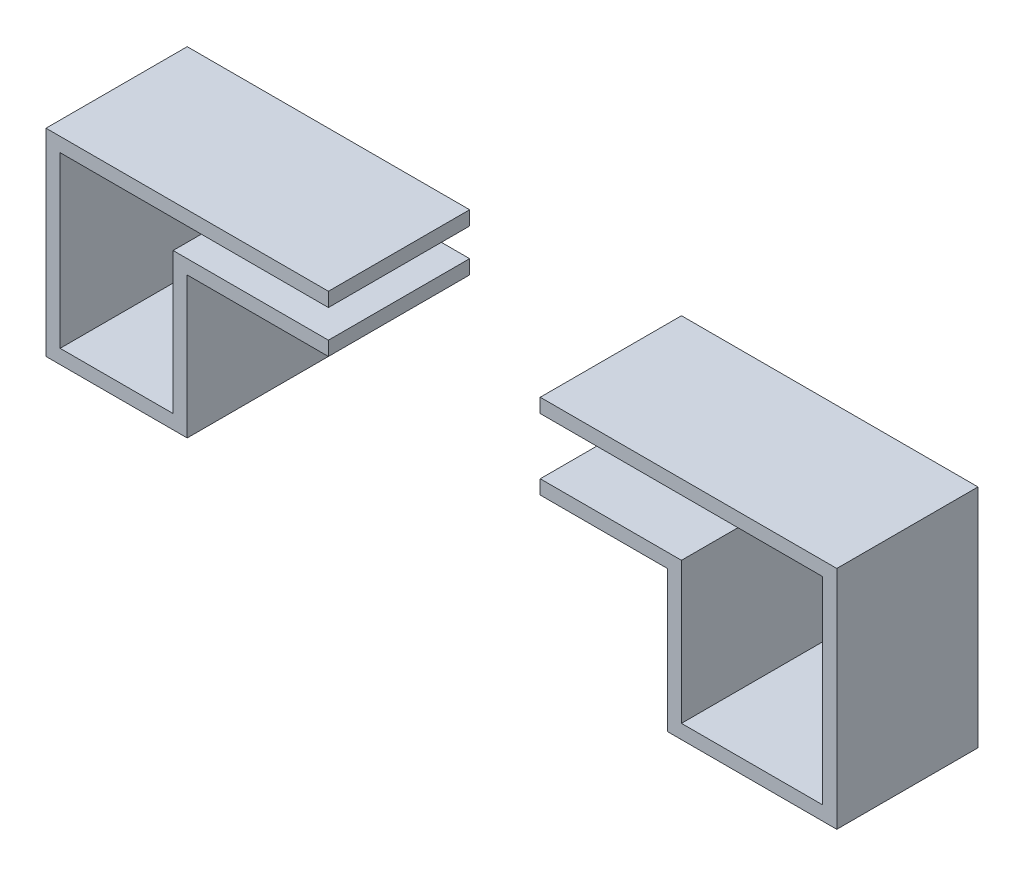
ISO-10303-21;
HEADER;
FILE_DESCRIPTION(('STEP AP214'),'2;1');
FILE_NAME('part.step','',(''),(''),'','','');
FILE_SCHEMA(('AUTOMOTIVE_DESIGN { 1 0 10303 214 1 1 1 1 }'));
ENDSEC;
DATA;
#1=APPLICATION_CONTEXT('core data for automotive mechanical design processes');
#2=APPLICATION_PROTOCOL_DEFINITION('international standard','automotive_design',2000,#1);
#3=PRODUCT_CONTEXT('',#1,'mechanical');
#4=PRODUCT('Part','Part','',(#3));
#5=PRODUCT_RELATED_PRODUCT_CATEGORY('part','',(#4));
#6=PRODUCT_DEFINITION_FORMATION('','',#4);
#7=PRODUCT_DEFINITION_CONTEXT('part definition',#1,'design');
#8=PRODUCT_DEFINITION('design','',#6,#7);
#9=PRODUCT_DEFINITION_SHAPE('','',#8);
#10=(LENGTH_UNIT() NAMED_UNIT(*) SI_UNIT(.MILLI.,.METRE.));
#11=(NAMED_UNIT(*) PLANE_ANGLE_UNIT() SI_UNIT($,.RADIAN.));
#12=(NAMED_UNIT(*) SI_UNIT($,.STERADIAN.) SOLID_ANGLE_UNIT());
#13=UNCERTAINTY_MEASURE_WITH_UNIT(LENGTH_MEASURE(1.E-05),#10,'distance_accuracy_value','');
#14=(GEOMETRIC_REPRESENTATION_CONTEXT(3) GLOBAL_UNCERTAINTY_ASSIGNED_CONTEXT((#13)) GLOBAL_UNIT_ASSIGNED_CONTEXT((#10,
#11,#12)) REPRESENTATION_CONTEXT('',''));
#15=CARTESIAN_POINT('',(0.,0.,0.));
#16=DIRECTION('',(0.,0.,1.));
#17=DIRECTION('',(1.,0.,0.));
#18=AXIS2_PLACEMENT_3D('',#15,#16,#17);
#19=CARTESIAN_POINT('',(1.375,0.75,0.5));
#20=DIRECTION('',(0.,-1.,0.));
#21=DIRECTION('',(1.,0.,0.));
#22=AXIS2_PLACEMENT_3D('',#19,#20,#21);
#23=PLANE('',#22);
#24=DIRECTION('',(-1.,0.,0.));
#25=VECTOR('',#24,1.);
#26=CARTESIAN_POINT('',(1.375,0.75,0.));
#27=LINE('',#26,#25);
#28=CARTESIAN_POINT('',(1.425,0.75,0.));
#29=VERTEX_POINT('',#28);
#30=CARTESIAN_POINT('',(0.374999999999999,0.75,0.));
#31=VERTEX_POINT('',#30);
#32=EDGE_CURVE('E178',#29,#31,#27,.T.);
#33=ORIENTED_EDGE('',*,*,#32,.T.);
#34=DIRECTION('',(0.,0.,-1.));
#35=VECTOR('',#34,1.);
#36=CARTESIAN_POINT('',(0.374999999999999,0.75,0.5));
#37=LINE('',#36,#35);
#38=CARTESIAN_POINT('',(0.374999999999999,0.75,0.5));
#39=VERTEX_POINT('',#38);
#40=EDGE_CURVE('E12',#39,#31,#37,.T.);
#41=ORIENTED_EDGE('',*,*,#40,.F.);
#42=DIRECTION('',(-1.,0.,0.));
#43=VECTOR('',#42,1.);
#44=CARTESIAN_POINT('',(1.375,0.75,0.5));
#45=LINE('',#44,#43);
#46=CARTESIAN_POINT('',(1.425,0.75,0.5));
#47=VERTEX_POINT('',#46);
#48=EDGE_CURVE('E122',#47,#39,#45,.T.);
#49=ORIENTED_EDGE('',*,*,#48,.F.);
#50=DIRECTION('',(0.,0.,-1.));
#51=VECTOR('',#50,1.);
#52=CARTESIAN_POINT('',(1.425,0.75,0.5));
#53=LINE('',#52,#51);
#54=EDGE_CURVE('E174',#47,#29,#53,.T.);
#55=ORIENTED_EDGE('',*,*,#54,.T.);
#56=EDGE_LOOP('',(#33,#41,#49,#55));
#57=FACE_BOUND('',#56,.T.);
#58=ADVANCED_FACE('F53',(#57),#23,.F.);
#59=CARTESIAN_POINT('',(0.374999999999999,0.7,0.5));
#60=DIRECTION('',(-1.,0.,0.));
#61=DIRECTION('',(0.,0.,1.));
#62=AXIS2_PLACEMENT_3D('',#59,#60,#61);
#63=PLANE('',#62);
#64=DIRECTION('',(0.,1.,0.));
#65=VECTOR('',#64,1.);
#66=CARTESIAN_POINT('',(0.374999999999999,0.7,0.));
#67=LINE('',#66,#65);
#68=CARTESIAN_POINT('',(0.374999999999999,0.7,0.));
#69=VERTEX_POINT('',#68);
#70=EDGE_CURVE('E182',#69,#31,#67,.T.);
#71=ORIENTED_EDGE('',*,*,#70,.F.);
#72=DIRECTION('',(0.,0.,-1.));
#73=VECTOR('',#72,1.);
#74=CARTESIAN_POINT('',(0.374999999999999,0.7,0.5));
#75=LINE('',#74,#73);
#76=CARTESIAN_POINT('',(0.374999999999999,0.7,0.5));
#77=VERTEX_POINT('',#76);
#78=EDGE_CURVE('E62',#77,#69,#75,.T.);
#79=ORIENTED_EDGE('',*,*,#78,.F.);
#80=DIRECTION('',(0.,1.,0.));
#81=VECTOR('',#80,1.);
#82=CARTESIAN_POINT('',(0.374999999999999,0.7,0.5));
#83=LINE('',#82,#81);
#84=EDGE_CURVE('E265',#77,#39,#83,.T.);
#85=ORIENTED_EDGE('',*,*,#84,.T.);
#86=ORIENTED_EDGE('',*,*,#40,.T.);
#87=EDGE_LOOP('',(#71,#79,#85,#86));
#88=FACE_BOUND('',#87,.T.);
#89=ADVANCED_FACE('F252',(#88),#63,.T.);
#90=CARTESIAN_POINT('',(1.375,0.7,0.5));
#91=DIRECTION('',(0.,-1.,0.));
#92=DIRECTION('',(1.,0.,0.));
#93=AXIS2_PLACEMENT_3D('',#90,#91,#92);
#94=PLANE('',#93);
#95=DIRECTION('',(-1.,0.,0.));
#96=VECTOR('',#95,1.);
#97=CARTESIAN_POINT('',(1.375,0.7,0.));
#98=LINE('',#97,#96);
#99=CARTESIAN_POINT('',(1.375,0.7,0.));
#100=VERTEX_POINT('',#99);
#101=EDGE_CURVE('E186',#100,#69,#98,.T.);
#102=ORIENTED_EDGE('',*,*,#101,.F.);
#103=DIRECTION('',(0.,0.,-1.));
#104=VECTOR('',#103,1.);
#105=CARTESIAN_POINT('',(1.375,0.7,0.5));
#106=LINE('',#105,#104);
#107=CARTESIAN_POINT('',(1.375,0.7,0.5));
#108=VERTEX_POINT('',#107);
#109=EDGE_CURVE('E240',#108,#100,#106,.T.);
#110=ORIENTED_EDGE('',*,*,#109,.F.);
#111=DIRECTION('',(-1.,0.,0.));
#112=VECTOR('',#111,1.);
#113=CARTESIAN_POINT('',(1.375,0.7,0.5));
#114=LINE('',#113,#112);
#115=EDGE_CURVE('E249',#108,#77,#114,.T.);
#116=ORIENTED_EDGE('',*,*,#115,.T.);
#117=ORIENTED_EDGE('',*,*,#78,.T.);
#118=EDGE_LOOP('',(#102,#110,#116,#117));
#119=FACE_BOUND('',#118,.T.);
#120=ADVANCED_FACE('F247',(#119),#94,.T.);
#121=CARTESIAN_POINT('',(1.375,0.,0.5));
#122=DIRECTION('',(-1.,0.,0.));
#123=DIRECTION('',(0.,0.,1.));
#124=AXIS2_PLACEMENT_3D('',#121,#122,#123);
#125=PLANE('',#124);
#126=DIRECTION('',(0.,1.,0.));
#127=VECTOR('',#126,1.);
#128=CARTESIAN_POINT('',(1.375,0.,0.));
#129=LINE('',#128,#127);
#130=CARTESIAN_POINT('',(1.375,0.,0.));
#131=VERTEX_POINT('',#130);
#132=EDGE_CURVE('E190',#131,#100,#129,.T.);
#133=ORIENTED_EDGE('',*,*,#132,.F.);
#134=DIRECTION('',(0.,0.,-1.));
#135=VECTOR('',#134,1.);
#136=CARTESIAN_POINT('',(1.375,0.,0.5));
#137=LINE('',#136,#135);
#138=CARTESIAN_POINT('',(1.375,0.,0.5));
#139=VERTEX_POINT('',#138);
#140=EDGE_CURVE('E237',#139,#131,#137,.T.);
#141=ORIENTED_EDGE('',*,*,#140,.F.);
#142=DIRECTION('',(0.,1.,0.));
#143=VECTOR('',#142,1.);
#144=CARTESIAN_POINT('',(1.375,0.,0.5));
#145=LINE('',#144,#143);
#146=EDGE_CURVE('E262',#139,#108,#145,.T.);
#147=ORIENTED_EDGE('',*,*,#146,.T.);
#148=ORIENTED_EDGE('',*,*,#109,.T.);
#149=EDGE_LOOP('',(#133,#141,#147,#148));
#150=FACE_BOUND('',#149,.T.);
#151=ADVANCED_FACE('F259',(#150),#125,.T.);
#152=CARTESIAN_POINT('',(0.874999999999999,0.,0.5));
#153=DIRECTION('',(0.,1.,0.));
#154=DIRECTION('',(0.,0.,1.));
#155=AXIS2_PLACEMENT_3D('',#152,#153,#154);
#156=PLANE('',#155);
#157=DIRECTION('',(1.,0.,0.));
#158=VECTOR('',#157,1.);
#159=CARTESIAN_POINT('',(0.874999999999999,0.,0.));
#160=LINE('',#159,#158);
#161=CARTESIAN_POINT('',(0.874999999999999,0.,0.));
#162=VERTEX_POINT('',#161);
#163=EDGE_CURVE('E194',#162,#131,#160,.T.);
#164=ORIENTED_EDGE('',*,*,#163,.F.);
#165=DIRECTION('',(0.,0.,-1.));
#166=VECTOR('',#165,1.);
#167=CARTESIAN_POINT('',(0.874999999999999,0.,0.5));
#168=LINE('',#167,#166);
#169=CARTESIAN_POINT('',(0.874999999999999,0.,0.5));
#170=VERTEX_POINT('',#169);
#171=EDGE_CURVE('E234',#170,#162,#168,.T.);
#172=ORIENTED_EDGE('',*,*,#171,.F.);
#173=DIRECTION('',(1.,0.,0.));
#174=VECTOR('',#173,1.);
#175=CARTESIAN_POINT('',(0.874999999999999,0.,0.5));
#176=LINE('',#175,#174);
#177=EDGE_CURVE('E270',#170,#139,#176,.T.);
#178=ORIENTED_EDGE('',*,*,#177,.T.);
#179=ORIENTED_EDGE('',*,*,#140,.T.);
#180=EDGE_LOOP('',(#164,#172,#178,#179));
#181=FACE_BOUND('',#180,.T.);
#182=ADVANCED_FACE('F382',(#181),#156,.T.);
#183=CARTESIAN_POINT('',(0.874999999999999,0.,0.5));
#184=DIRECTION('',(1.,0.,0.));
#185=DIRECTION('',(0.,0.,-1.));
#186=AXIS2_PLACEMENT_3D('',#183,#184,#185);
#187=PLANE('',#186);
#188=DIRECTION('',(0.,-1.,0.));
#189=VECTOR('',#188,1.);
#190=CARTESIAN_POINT('',(0.874999999999999,0.,0.));
#191=LINE('',#190,#189);
#192=CARTESIAN_POINT('',(0.874999999999999,0.5,0.));
#193=VERTEX_POINT('',#192);
#194=EDGE_CURVE('E198',#193,#162,#191,.T.);
#195=ORIENTED_EDGE('',*,*,#194,.F.);
#196=DIRECTION('',(0.,0.,-1.));
#197=VECTOR('',#196,1.);
#198=CARTESIAN_POINT('',(0.874999999999999,0.5,0.5));
#199=LINE('',#198,#197);
#200=CARTESIAN_POINT('',(0.874999999999999,0.5,0.5));
#201=VERTEX_POINT('',#200);
#202=EDGE_CURVE('E231',#201,#193,#199,.T.);
#203=ORIENTED_EDGE('',*,*,#202,.F.);
#204=DIRECTION('',(0.,-1.,0.));
#205=VECTOR('',#204,1.);
#206=CARTESIAN_POINT('',(0.874999999999999,0.,0.5));
#207=LINE('',#206,#205);
#208=EDGE_CURVE('E277',#201,#170,#207,.T.);
#209=ORIENTED_EDGE('',*,*,#208,.T.);
#210=ORIENTED_EDGE('',*,*,#171,.T.);
#211=EDGE_LOOP('',(#195,#203,#209,#210));
#212=FACE_BOUND('',#211,.T.);
#213=ADVANCED_FACE('F372',(#212),#187,.T.);
#214=CARTESIAN_POINT('',(0.874999999999999,0.5,0.5));
#215=DIRECTION('',(0.,1.,0.));
#216=DIRECTION('',(-1.,0.,0.));
#217=AXIS2_PLACEMENT_3D('',#214,#215,#216);
#218=PLANE('',#217);
#219=DIRECTION('',(1.,0.,0.));
#220=VECTOR('',#219,1.);
#221=CARTESIAN_POINT('',(0.874999999999999,0.5,0.));
#222=LINE('',#221,#220);
#223=CARTESIAN_POINT('',(0.374999999999999,0.5,0.));
#224=VERTEX_POINT('',#223);
#225=EDGE_CURVE('E202',#224,#193,#222,.T.);
#226=ORIENTED_EDGE('',*,*,#225,.F.);
#227=DIRECTION('',(0.,0.,-1.));
#228=VECTOR('',#227,1.);
#229=CARTESIAN_POINT('',(0.374999999999999,0.5,0.5));
#230=LINE('',#229,#228);
#231=CARTESIAN_POINT('',(0.374999999999999,0.5,0.5));
#232=VERTEX_POINT('',#231);
#233=EDGE_CURVE('E228',#232,#224,#230,.T.);
#234=ORIENTED_EDGE('',*,*,#233,.F.);
#235=DIRECTION('',(1.,0.,0.));
#236=VECTOR('',#235,1.);
#237=CARTESIAN_POINT('',(0.874999999999999,0.5,0.5));
#238=LINE('',#237,#236);
#239=EDGE_CURVE('E281',#232,#201,#238,.T.);
#240=ORIENTED_EDGE('',*,*,#239,.T.);
#241=ORIENTED_EDGE('',*,*,#202,.T.);
#242=EDGE_LOOP('',(#226,#234,#240,#241));
#243=FACE_BOUND('',#242,.T.);
#244=ADVANCED_FACE('F296',(#243),#218,.T.);
#245=CARTESIAN_POINT('',(0.374999999999999,0.45,0.5));
#246=DIRECTION('',(-1.,0.,0.));
#247=DIRECTION('',(0.,0.,1.));
#248=AXIS2_PLACEMENT_3D('',#245,#246,#247);
#249=PLANE('',#248);
#250=DIRECTION('',(0.,1.,0.));
#251=VECTOR('',#250,1.);
#252=CARTESIAN_POINT('',(0.374999999999999,0.45,0.));
#253=LINE('',#252,#251);
#254=CARTESIAN_POINT('',(0.374999999999999,0.45,0.));
#255=VERTEX_POINT('',#254);
#256=EDGE_CURVE('E206',#255,#224,#253,.T.);
#257=ORIENTED_EDGE('',*,*,#256,.F.);
#258=DIRECTION('',(0.,0.,-1.));
#259=VECTOR('',#258,1.);
#260=CARTESIAN_POINT('',(0.374999999999999,0.45,0.5));
#261=LINE('',#260,#259);
#262=CARTESIAN_POINT('',(0.374999999999999,0.45,0.5));
#263=VERTEX_POINT('',#262);
#264=EDGE_CURVE('E225',#263,#255,#261,.T.);
#265=ORIENTED_EDGE('',*,*,#264,.F.);
#266=DIRECTION('',(0.,1.,0.));
#267=VECTOR('',#266,1.);
#268=CARTESIAN_POINT('',(0.374999999999999,0.45,0.5));
#269=LINE('',#268,#267);
#270=EDGE_CURVE('E285',#263,#232,#269,.T.);
#271=ORIENTED_EDGE('',*,*,#270,.T.);
#272=ORIENTED_EDGE('',*,*,#233,.T.);
#273=EDGE_LOOP('',(#257,#265,#271,#272));
#274=FACE_BOUND('',#273,.T.);
#275=ADVANCED_FACE('F291',(#274),#249,.T.);
#276=CARTESIAN_POINT('',(0.874999999999999,0.45,0.5));
#277=DIRECTION('',(0.,1.,0.));
#278=DIRECTION('',(-1.,0.,0.));
#279=AXIS2_PLACEMENT_3D('',#276,#277,#278);
#280=PLANE('',#279);
#281=DIRECTION('',(1.,0.,0.));
#282=VECTOR('',#281,1.);
#283=CARTESIAN_POINT('',(0.874999999999999,0.45,0.));
#284=LINE('',#283,#282);
#285=CARTESIAN_POINT('',(0.824999999999999,0.45,0.));
#286=VERTEX_POINT('',#285);
#287=EDGE_CURVE('E210',#255,#286,#284,.T.);
#288=ORIENTED_EDGE('',*,*,#287,.T.);
#289=DIRECTION('',(0.,0.,-1.));
#290=VECTOR('',#289,1.);
#291=CARTESIAN_POINT('',(0.824999999999999,0.45,0.5));
#292=LINE('',#291,#290);
#293=CARTESIAN_POINT('',(0.824999999999999,0.45,0.5));
#294=VERTEX_POINT('',#293);
#295=EDGE_CURVE('E167',#294,#286,#292,.T.);
#296=ORIENTED_EDGE('',*,*,#295,.F.);
#297=DIRECTION('',(1.,0.,0.));
#298=VECTOR('',#297,1.);
#299=CARTESIAN_POINT('',(0.874999999999999,0.45,0.5));
#300=LINE('',#299,#298);
#301=EDGE_CURVE('E156',#263,#294,#300,.T.);
#302=ORIENTED_EDGE('',*,*,#301,.F.);
#303=ORIENTED_EDGE('',*,*,#264,.T.);
#304=EDGE_LOOP('',(#288,#296,#302,#303));
#305=FACE_BOUND('',#304,.T.);
#306=ADVANCED_FACE('F300',(#305),#280,.F.);
#307=CARTESIAN_POINT('',(0.824999999999999,0.,0.5));
#308=DIRECTION('',(1.,0.,0.));
#309=DIRECTION('',(0.,0.,-1.));
#310=AXIS2_PLACEMENT_3D('',#307,#308,#309);
#311=PLANE('',#310);
#312=DIRECTION('',(0.,1.,0.));
#313=VECTOR('',#312,1.);
#314=CARTESIAN_POINT('',(0.824999999999999,0.,0.));
#315=LINE('',#314,#313);
#316=CARTESIAN_POINT('',(0.824999999999999,-0.05,0.));
#317=VERTEX_POINT('',#316);
#318=EDGE_CURVE('E165',#286,#317,#315,.F.);
#319=ORIENTED_EDGE('',*,*,#318,.T.);
#320=DIRECTION('',(0.,0.,-1.));
#321=VECTOR('',#320,1.);
#322=CARTESIAN_POINT('',(0.824999999999999,-0.05,0.5));
#323=LINE('',#322,#321);
#324=CARTESIAN_POINT('',(0.824999999999999,-0.05,0.5));
#325=VERTEX_POINT('',#324);
#326=EDGE_CURVE('E162',#325,#317,#323,.T.);
#327=ORIENTED_EDGE('',*,*,#326,.F.);
#328=DIRECTION('',(0.,1.,0.));
#329=VECTOR('',#328,1.);
#330=CARTESIAN_POINT('',(0.824999999999999,0.,0.5));
#331=LINE('',#330,#329);
#332=EDGE_CURVE('E149',#294,#325,#331,.F.);
#333=ORIENTED_EDGE('',*,*,#332,.F.);
#334=ORIENTED_EDGE('',*,*,#295,.T.);
#335=EDGE_LOOP('',(#319,#327,#333,#334));
#336=FACE_BOUND('',#335,.T.);
#337=ADVANCED_FACE('F163',(#336),#311,.F.);
#338=CARTESIAN_POINT('',(0.874999999999999,-0.05,0.5));
#339=DIRECTION('',(0.,1.,0.));
#340=DIRECTION('',(0.,0.,1.));
#341=AXIS2_PLACEMENT_3D('',#338,#339,#340);
#342=PLANE('',#341);
#343=DIRECTION('',(1.,0.,0.));
#344=VECTOR('',#343,1.);
#345=CARTESIAN_POINT('',(0.874999999999999,-0.05,0.));
#346=LINE('',#345,#344);
#347=CARTESIAN_POINT('',(1.425,-0.05,0.));
#348=VERTEX_POINT('',#347);
#349=EDGE_CURVE('E110',#317,#348,#346,.T.);
#350=ORIENTED_EDGE('',*,*,#349,.T.);
#351=DIRECTION('',(0.,0.,-1.));
#352=VECTOR('',#351,1.);
#353=CARTESIAN_POINT('',(1.425,-0.05,0.5));
#354=LINE('',#353,#352);
#355=CARTESIAN_POINT('',(1.425,-0.05,0.5));
#356=VERTEX_POINT('',#355);
#357=EDGE_CURVE('E168',#356,#348,#354,.T.);
#358=ORIENTED_EDGE('',*,*,#357,.F.);
#359=DIRECTION('',(1.,0.,0.));
#360=VECTOR('',#359,1.);
#361=CARTESIAN_POINT('',(0.874999999999999,-0.05,0.5));
#362=LINE('',#361,#360);
#363=EDGE_CURVE('E153',#325,#356,#362,.T.);
#364=ORIENTED_EDGE('',*,*,#363,.F.);
#365=ORIENTED_EDGE('',*,*,#326,.T.);
#366=EDGE_LOOP('',(#350,#358,#364,#365));
#367=FACE_BOUND('',#366,.T.);
#368=ADVANCED_FACE('F170',(#367),#342,.F.);
#369=CARTESIAN_POINT('',(1.425,0.,0.5));
#370=DIRECTION('',(-1.,0.,0.));
#371=DIRECTION('',(0.,0.,1.));
#372=AXIS2_PLACEMENT_3D('',#369,#370,#371);
#373=PLANE('',#372);
#374=DIRECTION('',(0.,1.,0.));
#375=VECTOR('',#374,1.);
#376=CARTESIAN_POINT('',(1.425,0.,0.));
#377=LINE('',#376,#375);
#378=EDGE_CURVE('E116',#348,#29,#377,.T.);
#379=ORIENTED_EDGE('',*,*,#378,.T.);
#380=ORIENTED_EDGE('',*,*,#54,.F.);
#381=DIRECTION('',(0.,1.,0.));
#382=VECTOR('',#381,1.);
#383=CARTESIAN_POINT('',(1.425,0.,0.5));
#384=LINE('',#383,#382);
#385=EDGE_CURVE('E70',#356,#47,#384,.T.);
#386=ORIENTED_EDGE('',*,*,#385,.F.);
#387=ORIENTED_EDGE('',*,*,#357,.T.);
#388=EDGE_LOOP('',(#379,#380,#386,#387));
#389=FACE_BOUND('',#388,.T.);
#390=ADVANCED_FACE('F314',(#389),#373,.F.);
#391=CARTESIAN_POINT('',(0.,0.,0.5));
#392=DIRECTION('',(0.,0.,-1.));
#393=DIRECTION('',(-1.,0.,0.));
#394=AXIS2_PLACEMENT_3D('',#391,#392,#393);
#395=PLANE('',#394);
#396=ORIENTED_EDGE('',*,*,#48,.T.);
#397=ORIENTED_EDGE('',*,*,#84,.F.);
#398=ORIENTED_EDGE('',*,*,#115,.F.);
#399=ORIENTED_EDGE('',*,*,#146,.F.);
#400=ORIENTED_EDGE('',*,*,#177,.F.);
#401=ORIENTED_EDGE('',*,*,#208,.F.);
#402=ORIENTED_EDGE('',*,*,#239,.F.);
#403=ORIENTED_EDGE('',*,*,#270,.F.);
#404=ORIENTED_EDGE('',*,*,#301,.T.);
#405=ORIENTED_EDGE('',*,*,#332,.T.);
#406=ORIENTED_EDGE('',*,*,#363,.T.);
#407=ORIENTED_EDGE('',*,*,#385,.T.);
#408=EDGE_LOOP('',(#396,#397,#398,#399,#400,#401,#402,#403,#404,#405,#406,#407));
#409=FACE_BOUND('',#408,.T.);
#410=ADVANCED_FACE('F151',(#409),#395,.F.);
#411=CARTESIAN_POINT('',(0.,0.,0.));
#412=DIRECTION('',(0.,0.,-1.));
#413=DIRECTION('',(-1.,0.,0.));
#414=AXIS2_PLACEMENT_3D('',#411,#412,#413);
#415=PLANE('',#414);
#416=ORIENTED_EDGE('',*,*,#32,.F.);
#417=ORIENTED_EDGE('',*,*,#378,.F.);
#418=ORIENTED_EDGE('',*,*,#349,.F.);
#419=ORIENTED_EDGE('',*,*,#318,.F.);
#420=ORIENTED_EDGE('',*,*,#287,.F.);
#421=ORIENTED_EDGE('',*,*,#256,.T.);
#422=ORIENTED_EDGE('',*,*,#225,.T.);
#423=ORIENTED_EDGE('',*,*,#194,.T.);
#424=ORIENTED_EDGE('',*,*,#163,.T.);
#425=ORIENTED_EDGE('',*,*,#132,.T.);
#426=ORIENTED_EDGE('',*,*,#101,.T.);
#427=ORIENTED_EDGE('',*,*,#70,.T.);
#428=EDGE_LOOP('',(#416,#417,#418,#419,#420,#421,#422,#423,#424,#425,#426,#427));
#429=FACE_BOUND('',#428,.T.);
#430=ADVANCED_FACE('F255',(#429),#415,.T.);
#431=CLOSED_SHELL('',(#58,#89,#120,#151,#182,#213,#244,#275,#306,#337,#368,#390,#410,#430));
#432=MANIFOLD_SOLID_BREP('B2',#431);
#433=CARTESIAN_POINT('',(-1.375,0.65,0.5));
#434=DIRECTION('',(0.,1.,0.));
#435=DIRECTION('',(0.,0.,1.));
#436=AXIS2_PLACEMENT_3D('',#433,#434,#435);
#437=PLANE('',#436);
#438=DIRECTION('',(1.,0.,0.));
#439=VECTOR('',#438,1.);
#440=CARTESIAN_POINT('',(-1.375,0.65,0.));
#441=LINE('',#440,#439);
#442=CARTESIAN_POINT('',(-1.325,0.65,0.));
#443=VERTEX_POINT('',#442);
#444=CARTESIAN_POINT('',(-0.375,0.65,0.));
#445=VERTEX_POINT('',#444);
#446=EDGE_CURVE('E569',#443,#445,#441,.T.);
#447=ORIENTED_EDGE('',*,*,#446,.T.);
#448=DIRECTION('',(0.,0.,-1.));
#449=VECTOR('',#448,1.);
#450=CARTESIAN_POINT('',(-0.375,0.65,0.5));
#451=LINE('',#450,#449);
#452=CARTESIAN_POINT('',(-0.375,0.65,0.5));
#453=VERTEX_POINT('',#452);
#454=EDGE_CURVE('E51',#453,#445,#451,.T.);
#455=ORIENTED_EDGE('',*,*,#454,.F.);
#456=DIRECTION('',(1.,0.,0.));
#457=VECTOR('',#456,1.);
#458=CARTESIAN_POINT('',(-1.375,0.65,0.5));
#459=LINE('',#458,#457);
#460=CARTESIAN_POINT('',(-1.325,0.65,0.5));
#461=VERTEX_POINT('',#460);
#462=EDGE_CURVE('E517',#461,#453,#459,.T.);
#463=ORIENTED_EDGE('',*,*,#462,.F.);
#464=DIRECTION('',(0.,0.,-1.));
#465=VECTOR('',#464,1.);
#466=CARTESIAN_POINT('',(-1.325,0.65,0.5));
#467=LINE('',#466,#465);
#468=EDGE_CURVE('E565',#461,#443,#467,.T.);
#469=ORIENTED_EDGE('',*,*,#468,.T.);
#470=EDGE_LOOP('',(#447,#455,#463,#469));
#471=FACE_BOUND('',#470,.T.);
#472=ADVANCED_FACE('F449',(#471),#437,.F.);
#473=CARTESIAN_POINT('',(-0.375,0.7,0.5));
#474=DIRECTION('',(1.,0.,0.));
#475=DIRECTION('',(0.,0.,-1.));
#476=AXIS2_PLACEMENT_3D('',#473,#474,#475);
#477=PLANE('',#476);
#478=DIRECTION('',(0.,-1.,0.));
#479=VECTOR('',#478,1.);
#480=CARTESIAN_POINT('',(-0.375,0.7,0.));
#481=LINE('',#480,#479);
#482=CARTESIAN_POINT('',(-0.375,0.7,0.));
#483=VERTEX_POINT('',#482);
#484=EDGE_CURVE('E572',#483,#445,#481,.T.);
#485=ORIENTED_EDGE('',*,*,#484,.F.);
#486=DIRECTION('',(0.,0.,-1.));
#487=VECTOR('',#486,1.);
#488=CARTESIAN_POINT('',(-0.375,0.7,0.5));
#489=LINE('',#488,#487);
#490=CARTESIAN_POINT('',(-0.375,0.7,0.5));
#491=VERTEX_POINT('',#490);
#492=EDGE_CURVE('E457',#491,#483,#489,.T.);
#493=ORIENTED_EDGE('',*,*,#492,.F.);
#494=DIRECTION('',(0.,-1.,0.));
#495=VECTOR('',#494,1.);
#496=CARTESIAN_POINT('',(-0.375,0.7,0.5));
#497=LINE('',#496,#495);
#498=EDGE_CURVE('E634',#491,#453,#497,.T.);
#499=ORIENTED_EDGE('',*,*,#498,.T.);
#500=ORIENTED_EDGE('',*,*,#454,.T.);
#501=EDGE_LOOP('',(#485,#493,#499,#500));
#502=FACE_BOUND('',#501,.T.);
#503=ADVANCED_FACE('F621',(#502),#477,.T.);
#504=CARTESIAN_POINT('',(-1.375,0.7,0.5));
#505=DIRECTION('',(0.,1.,0.));
#506=DIRECTION('',(0.,0.,1.));
#507=AXIS2_PLACEMENT_3D('',#504,#505,#506);
#508=PLANE('',#507);
#509=DIRECTION('',(1.,0.,0.));
#510=VECTOR('',#509,1.);
#511=CARTESIAN_POINT('',(-1.375,0.7,0.));
#512=LINE('',#511,#510);
#513=CARTESIAN_POINT('',(-1.375,0.7,0.));
#514=VERTEX_POINT('',#513);
#515=EDGE_CURVE('E575',#514,#483,#512,.T.);
#516=ORIENTED_EDGE('',*,*,#515,.F.);
#517=DIRECTION('',(0.,0.,-1.));
#518=VECTOR('',#517,1.);
#519=CARTESIAN_POINT('',(-1.375,0.7,0.5));
#520=LINE('',#519,#518);
#521=CARTESIAN_POINT('',(-1.375,0.7,0.5));
#522=VERTEX_POINT('',#521);
#523=EDGE_CURVE('E611',#522,#514,#520,.T.);
#524=ORIENTED_EDGE('',*,*,#523,.F.);
#525=DIRECTION('',(1.,0.,0.));
#526=VECTOR('',#525,1.);
#527=CARTESIAN_POINT('',(-1.375,0.7,0.5));
#528=LINE('',#527,#526);
#529=EDGE_CURVE('E618',#522,#491,#528,.T.);
#530=ORIENTED_EDGE('',*,*,#529,.T.);
#531=ORIENTED_EDGE('',*,*,#492,.T.);
#532=EDGE_LOOP('',(#516,#524,#530,#531));
#533=FACE_BOUND('',#532,.T.);
#534=ADVANCED_FACE('F616',(#533),#508,.T.);
#535=CARTESIAN_POINT('',(-1.375,0.,0.5));
#536=DIRECTION('',(-1.,0.,0.));
#537=DIRECTION('',(0.,0.,1.));
#538=AXIS2_PLACEMENT_3D('',#535,#536,#537);
#539=PLANE('',#538);
#540=DIRECTION('',(0.,1.,0.));
#541=VECTOR('',#540,1.);
#542=CARTESIAN_POINT('',(-1.375,0.,0.));
#543=LINE('',#542,#541);
#544=CARTESIAN_POINT('',(-1.375,0.,0.));
#545=VERTEX_POINT('',#544);
#546=EDGE_CURVE('E578',#545,#514,#543,.T.);
#547=ORIENTED_EDGE('',*,*,#546,.F.);
#548=DIRECTION('',(0.,0.,-1.));
#549=VECTOR('',#548,1.);
#550=CARTESIAN_POINT('',(-1.375,0.,0.5));
#551=LINE('',#550,#549);
#552=CARTESIAN_POINT('',(-1.375,0.,0.5));
#553=VERTEX_POINT('',#552);
#554=EDGE_CURVE('E609',#553,#545,#551,.T.);
#555=ORIENTED_EDGE('',*,*,#554,.F.);
#556=DIRECTION('',(0.,1.,0.));
#557=VECTOR('',#556,1.);
#558=CARTESIAN_POINT('',(-1.375,0.,0.5));
#559=LINE('',#558,#557);
#560=EDGE_CURVE('E631',#553,#522,#559,.T.);
#561=ORIENTED_EDGE('',*,*,#560,.T.);
#562=ORIENTED_EDGE('',*,*,#523,.T.);
#563=EDGE_LOOP('',(#547,#555,#561,#562));
#564=FACE_BOUND('',#563,.T.);
#565=ADVANCED_FACE('F628',(#564),#539,.T.);
#566=CARTESIAN_POINT('',(-1.375,0.,0.5));
#567=DIRECTION('',(0.,-1.,0.));
#568=DIRECTION('',(0.,0.,-1.));
#569=AXIS2_PLACEMENT_3D('',#566,#567,#568);
#570=PLANE('',#569);
#571=DIRECTION('',(-1.,0.,0.));
#572=VECTOR('',#571,1.);
#573=CARTESIAN_POINT('',(-1.375,0.,0.));
#574=LINE('',#573,#572);
#575=CARTESIAN_POINT('',(-0.875,0.,0.));
#576=VERTEX_POINT('',#575);
#577=EDGE_CURVE('E581',#576,#545,#574,.T.);
#578=ORIENTED_EDGE('',*,*,#577,.F.);
#579=DIRECTION('',(0.,0.,-1.));
#580=VECTOR('',#579,1.);
#581=CARTESIAN_POINT('',(-0.875,0.,0.5));
#582=LINE('',#581,#580);
#583=CARTESIAN_POINT('',(-0.875,0.,0.5));
#584=VERTEX_POINT('',#583);
#585=EDGE_CURVE('E607',#584,#576,#582,.T.);
#586=ORIENTED_EDGE('',*,*,#585,.F.);
#587=DIRECTION('',(-1.,0.,0.));
#588=VECTOR('',#587,1.);
#589=CARTESIAN_POINT('',(-1.375,0.,0.5));
#590=LINE('',#589,#588);
#591=EDGE_CURVE('E636',#584,#553,#590,.T.);
#592=ORIENTED_EDGE('',*,*,#591,.T.);
#593=ORIENTED_EDGE('',*,*,#554,.T.);
#594=EDGE_LOOP('',(#578,#586,#592,#593));
#595=FACE_BOUND('',#594,.T.);
#596=ADVANCED_FACE('F743',(#595),#570,.T.);
#597=CARTESIAN_POINT('',(-0.875,0.,0.5));
#598=DIRECTION('',(1.,0.,0.));
#599=DIRECTION('',(0.,0.,-1.));
#600=AXIS2_PLACEMENT_3D('',#597,#598,#599);
#601=PLANE('',#600);
#602=DIRECTION('',(0.,-1.,0.));
#603=VECTOR('',#602,1.);
#604=CARTESIAN_POINT('',(-0.875,0.,0.));
#605=LINE('',#604,#603);
#606=CARTESIAN_POINT('',(-0.875,0.5,0.));
#607=VERTEX_POINT('',#606);
#608=EDGE_CURVE('E584',#607,#576,#605,.T.);
#609=ORIENTED_EDGE('',*,*,#608,.F.);
#610=DIRECTION('',(0.,0.,-1.));
#611=VECTOR('',#610,1.);
#612=CARTESIAN_POINT('',(-0.875,0.5,0.5));
#613=LINE('',#612,#611);
#614=CARTESIAN_POINT('',(-0.875,0.5,0.5));
#615=VERTEX_POINT('',#614);
#616=EDGE_CURVE('E605',#615,#607,#613,.T.);
#617=ORIENTED_EDGE('',*,*,#616,.F.);
#618=DIRECTION('',(0.,-1.,0.));
#619=VECTOR('',#618,1.);
#620=CARTESIAN_POINT('',(-0.875,0.,0.5));
#621=LINE('',#620,#619);
#622=EDGE_CURVE('E642',#615,#584,#621,.T.);
#623=ORIENTED_EDGE('',*,*,#622,.T.);
#624=ORIENTED_EDGE('',*,*,#585,.T.);
#625=EDGE_LOOP('',(#609,#617,#623,#624));
#626=FACE_BOUND('',#625,.T.);
#627=ADVANCED_FACE('F733',(#626),#601,.T.);
#628=CARTESIAN_POINT('',(-0.875,0.5,0.5));
#629=DIRECTION('',(0.,-1.,0.));
#630=DIRECTION('',(0.,0.,-1.));
#631=AXIS2_PLACEMENT_3D('',#628,#629,#630);
#632=PLANE('',#631);
#633=DIRECTION('',(-1.,0.,0.));
#634=VECTOR('',#633,1.);
#635=CARTESIAN_POINT('',(-0.875,0.5,0.));
#636=LINE('',#635,#634);
#637=CARTESIAN_POINT('',(-0.375,0.5,0.));
#638=VERTEX_POINT('',#637);
#639=EDGE_CURVE('E587',#638,#607,#636,.T.);
#640=ORIENTED_EDGE('',*,*,#639,.F.);
#641=DIRECTION('',(0.,0.,-1.));
#642=VECTOR('',#641,1.);
#643=CARTESIAN_POINT('',(-0.375,0.5,0.5));
#644=LINE('',#643,#642);
#645=CARTESIAN_POINT('',(-0.375,0.5,0.5));
#646=VERTEX_POINT('',#645);
#647=EDGE_CURVE('E603',#646,#638,#644,.T.);
#648=ORIENTED_EDGE('',*,*,#647,.F.);
#649=DIRECTION('',(-1.,0.,0.));
#650=VECTOR('',#649,1.);
#651=CARTESIAN_POINT('',(-0.875,0.5,0.5));
#652=LINE('',#651,#650);
#653=EDGE_CURVE('E645',#646,#615,#652,.T.);
#654=ORIENTED_EDGE('',*,*,#653,.T.);
#655=ORIENTED_EDGE('',*,*,#616,.T.);
#656=EDGE_LOOP('',(#640,#648,#654,#655));
#657=FACE_BOUND('',#656,.T.);
#658=ADVANCED_FACE('F657',(#657),#632,.T.);
#659=CARTESIAN_POINT('',(-0.375,0.55,0.5));
#660=DIRECTION('',(1.,0.,0.));
#661=DIRECTION('',(0.,0.,-1.));
#662=AXIS2_PLACEMENT_3D('',#659,#660,#661);
#663=PLANE('',#662);
#664=DIRECTION('',(0.,-1.,0.));
#665=VECTOR('',#664,1.);
#666=CARTESIAN_POINT('',(-0.375,0.55,0.));
#667=LINE('',#666,#665);
#668=CARTESIAN_POINT('',(-0.375,0.55,0.));
#669=VERTEX_POINT('',#668);
#670=EDGE_CURVE('E590',#669,#638,#667,.T.);
#671=ORIENTED_EDGE('',*,*,#670,.F.);
#672=DIRECTION('',(0.,0.,-1.));
#673=VECTOR('',#672,1.);
#674=CARTESIAN_POINT('',(-0.375,0.55,0.5));
#675=LINE('',#674,#673);
#676=CARTESIAN_POINT('',(-0.375,0.55,0.5));
#677=VERTEX_POINT('',#676);
#678=EDGE_CURVE('E601',#677,#669,#675,.T.);
#679=ORIENTED_EDGE('',*,*,#678,.F.);
#680=DIRECTION('',(0.,-1.,0.));
#681=VECTOR('',#680,1.);
#682=CARTESIAN_POINT('',(-0.375,0.55,0.5));
#683=LINE('',#682,#681);
#684=EDGE_CURVE('E648',#677,#646,#683,.T.);
#685=ORIENTED_EDGE('',*,*,#684,.T.);
#686=ORIENTED_EDGE('',*,*,#647,.T.);
#687=EDGE_LOOP('',(#671,#679,#685,#686));
#688=FACE_BOUND('',#687,.T.);
#689=ADVANCED_FACE('F652',(#688),#663,.T.);
#690=CARTESIAN_POINT('',(-0.875,0.55,0.5));
#691=DIRECTION('',(0.,-1.,0.));
#692=DIRECTION('',(0.,0.,-1.));
#693=AXIS2_PLACEMENT_3D('',#690,#691,#692);
#694=PLANE('',#693);
#695=DIRECTION('',(1.,0.,0.));
#696=VECTOR('',#695,1.);
#697=CARTESIAN_POINT('',(-0.875,0.55,0.));
#698=LINE('',#697,#696);
#699=CARTESIAN_POINT('',(-0.925,0.55,0.));
#700=VERTEX_POINT('',#699);
#701=EDGE_CURVE('E593',#669,#700,#698,.F.);
#702=ORIENTED_EDGE('',*,*,#701,.T.);
#703=DIRECTION('',(0.,0.,-1.));
#704=VECTOR('',#703,1.);
#705=CARTESIAN_POINT('',(-0.925,0.55,0.5));
#706=LINE('',#705,#704);
#707=CARTESIAN_POINT('',(-0.925,0.55,0.5));
#708=VERTEX_POINT('',#707);
#709=EDGE_CURVE('E560',#708,#700,#706,.T.);
#710=ORIENTED_EDGE('',*,*,#709,.F.);
#711=DIRECTION('',(1.,0.,0.));
#712=VECTOR('',#711,1.);
#713=CARTESIAN_POINT('',(-0.875,0.55,0.5));
#714=LINE('',#713,#712);
#715=EDGE_CURVE('E551',#677,#708,#714,.F.);
#716=ORIENTED_EDGE('',*,*,#715,.F.);
#717=ORIENTED_EDGE('',*,*,#678,.T.);
#718=EDGE_LOOP('',(#702,#710,#716,#717));
#719=FACE_BOUND('',#718,.T.);
#720=ADVANCED_FACE('F661',(#719),#694,.F.);
#721=CARTESIAN_POINT('',(-0.925,0.,0.5));
#722=DIRECTION('',(1.,0.,0.));
#723=DIRECTION('',(0.,0.,-1.));
#724=AXIS2_PLACEMENT_3D('',#721,#722,#723);
#725=PLANE('',#724);
#726=DIRECTION('',(0.,1.,0.));
#727=VECTOR('',#726,1.);
#728=CARTESIAN_POINT('',(-0.925,0.,0.));
#729=LINE('',#728,#727);
#730=CARTESIAN_POINT('',(-0.925,0.05,0.));
#731=VERTEX_POINT('',#730);
#732=EDGE_CURVE('E559',#700,#731,#729,.F.);
#733=ORIENTED_EDGE('',*,*,#732,.T.);
#734=DIRECTION('',(0.,0.,-1.));
#735=VECTOR('',#734,1.);
#736=CARTESIAN_POINT('',(-0.925,0.05,0.5));
#737=LINE('',#736,#735);
#738=CARTESIAN_POINT('',(-0.925,0.05,0.5));
#739=VERTEX_POINT('',#738);
#740=EDGE_CURVE('E556',#739,#731,#737,.T.);
#741=ORIENTED_EDGE('',*,*,#740,.F.);
#742=DIRECTION('',(0.,1.,0.));
#743=VECTOR('',#742,1.);
#744=CARTESIAN_POINT('',(-0.925,0.,0.5));
#745=LINE('',#744,#743);
#746=EDGE_CURVE('E544',#708,#739,#745,.F.);
#747=ORIENTED_EDGE('',*,*,#746,.F.);
#748=ORIENTED_EDGE('',*,*,#709,.T.);
#749=EDGE_LOOP('',(#733,#741,#747,#748));
#750=FACE_BOUND('',#749,.T.);
#751=ADVANCED_FACE('F557',(#750),#725,.F.);
#752=CARTESIAN_POINT('',(-1.375,0.05,0.5));
#753=DIRECTION('',(0.,-1.,0.));
#754=DIRECTION('',(0.,0.,-1.));
#755=AXIS2_PLACEMENT_3D('',#752,#753,#754);
#756=PLANE('',#755);
#757=DIRECTION('',(1.,0.,0.));
#758=VECTOR('',#757,1.);
#759=CARTESIAN_POINT('',(-1.375,0.05,0.));
#760=LINE('',#759,#758);
#761=CARTESIAN_POINT('',(-1.325,0.05,0.));
#762=VERTEX_POINT('',#761);
#763=EDGE_CURVE('E505',#731,#762,#760,.F.);
#764=ORIENTED_EDGE('',*,*,#763,.T.);
#765=DIRECTION('',(0.,0.,-1.));
#766=VECTOR('',#765,1.);
#767=CARTESIAN_POINT('',(-1.325,0.05,0.5));
#768=LINE('',#767,#766);
#769=CARTESIAN_POINT('',(-1.325,0.05,0.5));
#770=VERTEX_POINT('',#769);
#771=EDGE_CURVE('E561',#770,#762,#768,.T.);
#772=ORIENTED_EDGE('',*,*,#771,.F.);
#773=DIRECTION('',(1.,0.,0.));
#774=VECTOR('',#773,1.);
#775=CARTESIAN_POINT('',(-1.375,0.05,0.5));
#776=LINE('',#775,#774);
#777=EDGE_CURVE('E548',#739,#770,#776,.F.);
#778=ORIENTED_EDGE('',*,*,#777,.F.);
#779=ORIENTED_EDGE('',*,*,#740,.T.);
#780=EDGE_LOOP('',(#764,#772,#778,#779));
#781=FACE_BOUND('',#780,.T.);
#782=ADVANCED_FACE('F563',(#781),#756,.F.);
#783=CARTESIAN_POINT('',(-1.325,0.,0.5));
#784=DIRECTION('',(-1.,0.,0.));
#785=DIRECTION('',(0.,0.,1.));
#786=AXIS2_PLACEMENT_3D('',#783,#784,#785);
#787=PLANE('',#786);
#788=DIRECTION('',(0.,1.,0.));
#789=VECTOR('',#788,1.);
#790=CARTESIAN_POINT('',(-1.325,0.,0.));
#791=LINE('',#790,#789);
#792=EDGE_CURVE('E511',#762,#443,#791,.T.);
#793=ORIENTED_EDGE('',*,*,#792,.T.);
#794=ORIENTED_EDGE('',*,*,#468,.F.);
#795=DIRECTION('',(0.,1.,0.));
#796=VECTOR('',#795,1.);
#797=CARTESIAN_POINT('',(-1.325,0.,0.5));
#798=LINE('',#797,#796);
#799=EDGE_CURVE('E465',#770,#461,#798,.T.);
#800=ORIENTED_EDGE('',*,*,#799,.F.);
#801=ORIENTED_EDGE('',*,*,#771,.T.);
#802=EDGE_LOOP('',(#793,#794,#800,#801));
#803=FACE_BOUND('',#802,.T.);
#804=ADVANCED_FACE('F675',(#803),#787,.F.);
#805=CARTESIAN_POINT('',(0.,0.,0.5));
#806=DIRECTION('',(0.,0.,-1.));
#807=DIRECTION('',(-1.,0.,0.));
#808=AXIS2_PLACEMENT_3D('',#805,#806,#807);
#809=PLANE('',#808);
#810=ORIENTED_EDGE('',*,*,#462,.T.);
#811=ORIENTED_EDGE('',*,*,#498,.F.);
#812=ORIENTED_EDGE('',*,*,#529,.F.);
#813=ORIENTED_EDGE('',*,*,#560,.F.);
#814=ORIENTED_EDGE('',*,*,#591,.F.);
#815=ORIENTED_EDGE('',*,*,#622,.F.);
#816=ORIENTED_EDGE('',*,*,#653,.F.);
#817=ORIENTED_EDGE('',*,*,#684,.F.);
#818=ORIENTED_EDGE('',*,*,#715,.T.);
#819=ORIENTED_EDGE('',*,*,#746,.T.);
#820=ORIENTED_EDGE('',*,*,#777,.T.);
#821=ORIENTED_EDGE('',*,*,#799,.T.);
#822=EDGE_LOOP('',(#810,#811,#812,#813,#814,#815,#816,#817,#818,#819,#820,#821));
#823=FACE_BOUND('',#822,.T.);
#824=ADVANCED_FACE('F546',(#823),#809,.F.);
#825=CARTESIAN_POINT('',(0.,0.,0.));
#826=DIRECTION('',(0.,0.,-1.));
#827=DIRECTION('',(-1.,0.,0.));
#828=AXIS2_PLACEMENT_3D('',#825,#826,#827);
#829=PLANE('',#828);
#830=ORIENTED_EDGE('',*,*,#446,.F.);
#831=ORIENTED_EDGE('',*,*,#792,.F.);
#832=ORIENTED_EDGE('',*,*,#763,.F.);
#833=ORIENTED_EDGE('',*,*,#732,.F.);
#834=ORIENTED_EDGE('',*,*,#701,.F.);
#835=ORIENTED_EDGE('',*,*,#670,.T.);
#836=ORIENTED_EDGE('',*,*,#639,.T.);
#837=ORIENTED_EDGE('',*,*,#608,.T.);
#838=ORIENTED_EDGE('',*,*,#577,.T.);
#839=ORIENTED_EDGE('',*,*,#546,.T.);
#840=ORIENTED_EDGE('',*,*,#515,.T.);
#841=ORIENTED_EDGE('',*,*,#484,.T.);
#842=EDGE_LOOP('',(#830,#831,#832,#833,#834,#835,#836,#837,#838,#839,#840,#841));
#843=FACE_BOUND('',#842,.T.);
#844=ADVANCED_FACE('F624',(#843),#829,.T.);
#845=CLOSED_SHELL('',(#472,#503,#534,#565,#596,#627,#658,#689,#720,#751,#782,#804,#824,#844));
#846=MANIFOLD_SOLID_BREP('B6',#845);
#847=ADVANCED_BREP_SHAPE_REPRESENTATION('',(#18,#432,#846),#14);
#848=SHAPE_DEFINITION_REPRESENTATION(#9,#847);
ENDSEC;
END-ISO-10303-21;
